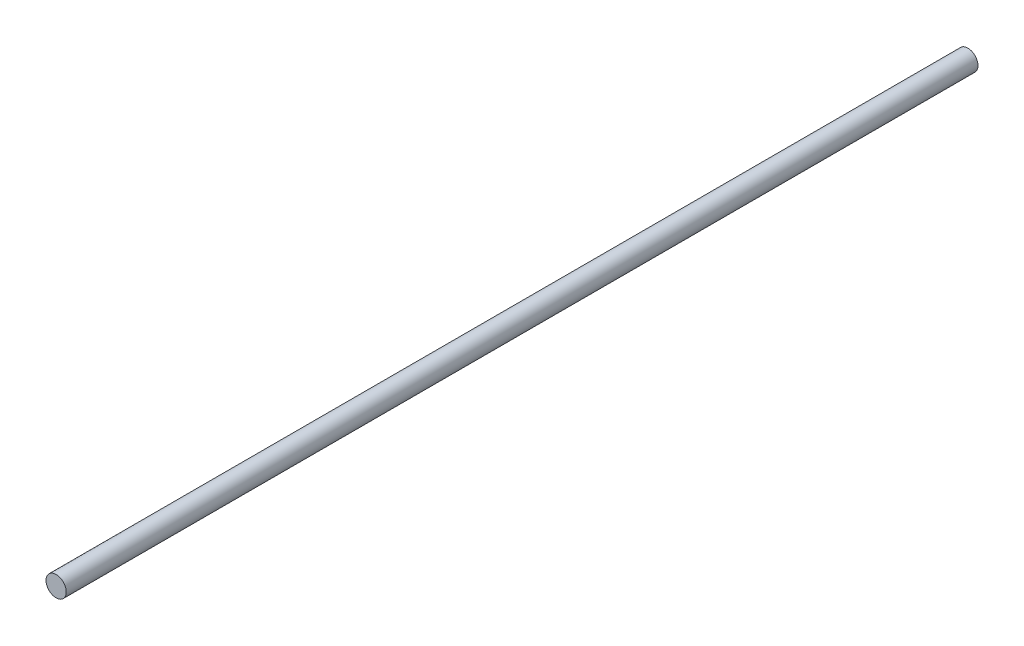
ISO-10303-21;
HEADER;
FILE_DESCRIPTION(('STEP AP214'),'2;1');
FILE_NAME('part.step','',(''),(''),'','','');
FILE_SCHEMA(('AUTOMOTIVE_DESIGN { 1 0 10303 214 1 1 1 1 }'));
ENDSEC;
DATA;
#1=APPLICATION_CONTEXT('core data for automotive mechanical design processes');
#2=APPLICATION_PROTOCOL_DEFINITION('international standard','automotive_design',2000,#1);
#3=PRODUCT_CONTEXT('',#1,'mechanical');
#4=PRODUCT('Part','Part','',(#3));
#5=PRODUCT_RELATED_PRODUCT_CATEGORY('part','',(#4));
#6=PRODUCT_DEFINITION_FORMATION('','',#4);
#7=PRODUCT_DEFINITION_CONTEXT('part definition',#1,'design');
#8=PRODUCT_DEFINITION('design','',#6,#7);
#9=PRODUCT_DEFINITION_SHAPE('','',#8);
#10=(LENGTH_UNIT() NAMED_UNIT(*) SI_UNIT(.MILLI.,.METRE.));
#11=(NAMED_UNIT(*) PLANE_ANGLE_UNIT() SI_UNIT($,.RADIAN.));
#12=(NAMED_UNIT(*) SI_UNIT($,.STERADIAN.) SOLID_ANGLE_UNIT());
#13=UNCERTAINTY_MEASURE_WITH_UNIT(LENGTH_MEASURE(1.E-05),#10,'distance_accuracy_value','');
#14=(GEOMETRIC_REPRESENTATION_CONTEXT(3) GLOBAL_UNCERTAINTY_ASSIGNED_CONTEXT((#13)) GLOBAL_UNIT_ASSIGNED_CONTEXT((#10,
#11,#12)) REPRESENTATION_CONTEXT('',''));
#15=CARTESIAN_POINT('',(0.,0.,0.));
#16=DIRECTION('',(0.,0.,1.));
#17=DIRECTION('',(1.,0.,0.));
#18=AXIS2_PLACEMENT_3D('',#15,#16,#17);
#19=CARTESIAN_POINT('',(0.,0.,-360.));
#20=DIRECTION('',(0.,0.,1.));
#21=DIRECTION('',(1.,0.,0.));
#22=AXIS2_PLACEMENT_3D('',#19,#20,#21);
#23=CYLINDRICAL_SURFACE('',#22,4.);
#24=CARTESIAN_POINT('',(0.,0.,-360.));
#25=DIRECTION('',(0.,0.,1.));
#26=DIRECTION('',(1.,0.,0.));
#27=AXIS2_PLACEMENT_3D('',#24,#25,#26);
#28=CIRCLE('',#27,4.);
#29=CARTESIAN_POINT('',(4.,0.,-360.));
#30=VERTEX_POINT('',#29);
#31=EDGE_CURVE('E10',#30,#30,#28,.T.);
#32=ORIENTED_EDGE('',*,*,#31,.T.);
#33=EDGE_LOOP('',(#32));
#34=FACE_BOUND('',#33,.T.);
#35=CARTESIAN_POINT('',(0.,0.,0.));
#36=DIRECTION('',(0.,0.,1.));
#37=DIRECTION('',(1.,0.,0.));
#38=AXIS2_PLACEMENT_3D('',#35,#36,#37);
#39=CIRCLE('',#38,4.);
#40=CARTESIAN_POINT('',(4.,0.,0.));
#41=VERTEX_POINT('',#40);
#42=EDGE_CURVE('E32',#41,#41,#39,.T.);
#43=ORIENTED_EDGE('',*,*,#42,.F.);
#44=EDGE_LOOP('',(#43));
#45=FACE_BOUND('',#44,.T.);
#46=ADVANCED_FACE('F29',(#34,#45),#23,.T.);
#47=CARTESIAN_POINT('',(0.,0.,-360.));
#48=DIRECTION('',(0.,0.,1.));
#49=DIRECTION('',(1.,0.,0.));
#50=AXIS2_PLACEMENT_3D('',#47,#48,#49);
#51=PLANE('',#50);
#52=ORIENTED_EDGE('',*,*,#31,.F.);
#53=EDGE_LOOP('',(#52));
#54=FACE_BOUND('',#53,.T.);
#55=ADVANCED_FACE('F44',(#54),#51,.F.);
#56=CARTESIAN_POINT('',(0.,0.,0.));
#57=DIRECTION('',(0.,0.,1.));
#58=DIRECTION('',(1.,0.,0.));
#59=AXIS2_PLACEMENT_3D('',#56,#57,#58);
#60=PLANE('',#59);
#61=ORIENTED_EDGE('',*,*,#42,.T.);
#62=EDGE_LOOP('',(#61));
#63=FACE_BOUND('',#62,.T.);
#64=ADVANCED_FACE('F41',(#63),#60,.T.);
#65=CLOSED_SHELL('',(#46,#55,#64));
#66=MANIFOLD_SOLID_BREP('B2',#65);
#67=ADVANCED_BREP_SHAPE_REPRESENTATION('',(#18,#66),#14);
#68=SHAPE_DEFINITION_REPRESENTATION(#9,#67);
ENDSEC;
END-ISO-10303-21;
